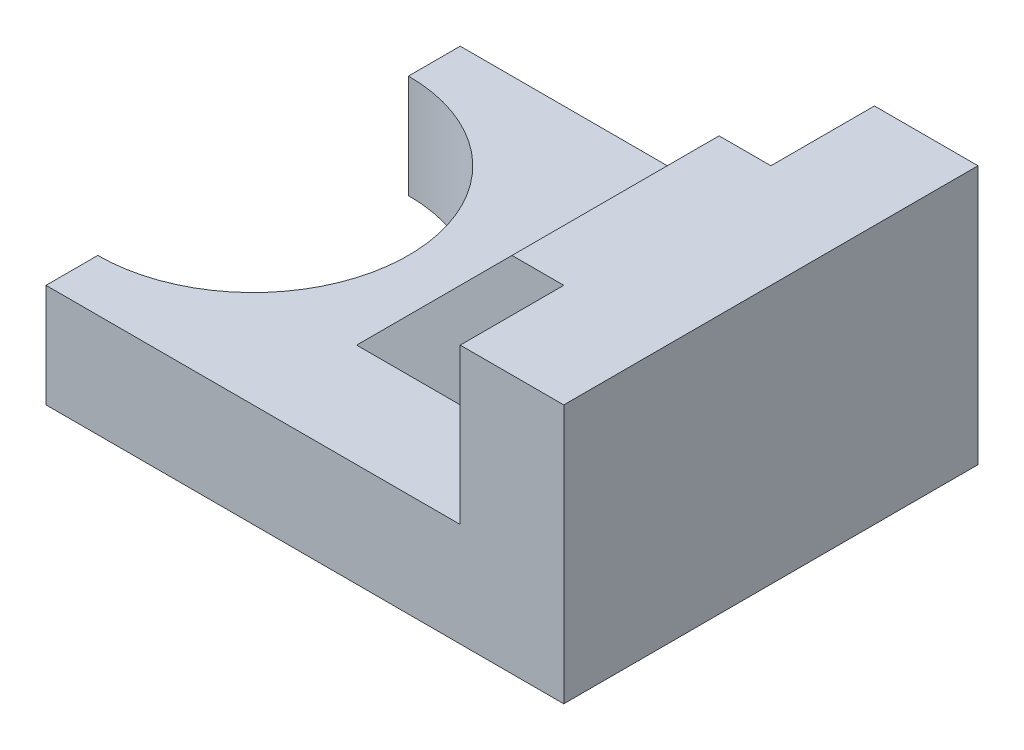
ISO-10303-21;
HEADER;
FILE_DESCRIPTION(('STEP AP214'),'2;1');
FILE_NAME('part.step','',(''),(''),'','','');
FILE_SCHEMA(('AUTOMOTIVE_DESIGN { 1 0 10303 214 1 1 1 1 }'));
ENDSEC;
DATA;
#1=APPLICATION_CONTEXT('core data for automotive mechanical design processes');
#2=APPLICATION_PROTOCOL_DEFINITION('international standard','automotive_design',2000,#1);
#3=PRODUCT_CONTEXT('',#1,'mechanical');
#4=PRODUCT('Part','Part','',(#3));
#5=PRODUCT_RELATED_PRODUCT_CATEGORY('part','',(#4));
#6=PRODUCT_DEFINITION_FORMATION('','',#4);
#7=PRODUCT_DEFINITION_CONTEXT('part definition',#1,'design');
#8=PRODUCT_DEFINITION('design','',#6,#7);
#9=PRODUCT_DEFINITION_SHAPE('','',#8);
#10=(LENGTH_UNIT() NAMED_UNIT(*) SI_UNIT(.MILLI.,.METRE.));
#11=(NAMED_UNIT(*) PLANE_ANGLE_UNIT() SI_UNIT($,.RADIAN.));
#12=(NAMED_UNIT(*) SI_UNIT($,.STERADIAN.) SOLID_ANGLE_UNIT());
#13=UNCERTAINTY_MEASURE_WITH_UNIT(LENGTH_MEASURE(1.E-05),#10,'distance_accuracy_value','');
#14=(GEOMETRIC_REPRESENTATION_CONTEXT(3) GLOBAL_UNCERTAINTY_ASSIGNED_CONTEXT((#13)) GLOBAL_UNIT_ASSIGNED_CONTEXT((#10,
#11,#12)) REPRESENTATION_CONTEXT('',''));
#15=CARTESIAN_POINT('',(0.,0.,0.));
#16=DIRECTION('',(0.,0.,1.));
#17=DIRECTION('',(1.,0.,0.));
#18=AXIS2_PLACEMENT_3D('',#15,#16,#17);
#19=CARTESIAN_POINT('',(-24.5117949113934,0.,20.));
#20=DIRECTION('',(-1.,0.,0.));
#21=DIRECTION('',(0.,0.,1.));
#22=AXIS2_PLACEMENT_3D('',#19,#20,#21);
#23=PLANE('',#22);
#24=DIRECTION('',(0.,1.,0.));
#25=VECTOR('',#24,1.);
#26=CARTESIAN_POINT('',(-24.5117949113934,-16.865406779661,15.));
#27=LINE('',#26,#25);
#28=CARTESIAN_POINT('',(-24.5117949113934,-16.864406779661,15.));
#29=VERTEX_POINT('',#28);
#30=CARTESIAN_POINT('',(-24.5117949113934,-6.86440677966101,15.));
#31=VERTEX_POINT('',#30);
#32=EDGE_CURVE('E137',#29,#31,#27,.T.);
#33=ORIENTED_EDGE('',*,*,#32,.F.);
#34=DIRECTION('',(0.,0.,-1.));
#35=VECTOR('',#34,1.);
#36=CARTESIAN_POINT('',(-24.5117949113934,-16.864406779661,20.));
#37=LINE('',#36,#35);
#38=CARTESIAN_POINT('',(-24.5117949113934,-16.864406779661,20.));
#39=VERTEX_POINT('',#38);
#40=EDGE_CURVE('E157',#39,#29,#37,.T.);
#41=ORIENTED_EDGE('',*,*,#40,.F.);
#42=DIRECTION('',(0.,1.,0.));
#43=VECTOR('',#42,1.);
#44=CARTESIAN_POINT('',(-24.5117949113934,0.,20.));
#45=LINE('',#44,#43);
#46=CARTESIAN_POINT('',(-24.5117949113934,-6.86440677966102,20.));
#47=VERTEX_POINT('',#46);
#48=EDGE_CURVE('E207',#39,#47,#45,.T.);
#49=ORIENTED_EDGE('',*,*,#48,.T.);
#50=DIRECTION('',(0.,0.,-1.));
#51=VECTOR('',#50,1.);
#52=CARTESIAN_POINT('',(-24.5117949113934,-6.86440677966102,20.));
#53=LINE('',#52,#51);
#54=EDGE_CURVE('E54',#47,#31,#53,.T.);
#55=ORIENTED_EDGE('',*,*,#54,.T.);
#56=EDGE_LOOP('',(#33,#41,#49,#55));
#57=FACE_BOUND('',#56,.T.);
#58=ADVANCED_FACE('F45',(#57),#23,.T.);
#59=CARTESIAN_POINT('',(0.,8.13559322033899,20.));
#60=DIRECTION('',(0.,1.,0.));
#61=DIRECTION('',(0.,0.,1.));
#62=AXIS2_PLACEMENT_3D('',#59,#60,#61);
#63=PLANE('',#62);
#64=DIRECTION('',(0.,0.,-1.));
#65=VECTOR('',#64,1.);
#66=CARTESIAN_POINT('',(15.4882050886066,8.13559322033899,-9.99999999999999));
#67=LINE('',#66,#65);
#68=CARTESIAN_POINT('',(15.4882050886066,8.13559322033899,-9.99999999999999));
#69=VERTEX_POINT('',#68);
#70=CARTESIAN_POINT('',(15.4882050886066,8.13559322033899,-20.));
#71=VERTEX_POINT('',#70);
#72=EDGE_CURVE('E69',#69,#71,#67,.T.);
#73=ORIENTED_EDGE('',*,*,#72,.F.);
#74=DIRECTION('',(1.,0.,0.));
#75=VECTOR('',#74,1.);
#76=CARTESIAN_POINT('',(10.4882050886066,8.13559322033899,-9.99999999999999));
#77=LINE('',#76,#75);
#78=CARTESIAN_POINT('',(10.4882050886066,8.13559322033899,-9.99999999999999));
#79=VERTEX_POINT('',#78);
#80=EDGE_CURVE('E249',#79,#69,#77,.T.);
#81=ORIENTED_EDGE('',*,*,#80,.F.);
#82=DIRECTION('',(0.,0.,-1.));
#83=VECTOR('',#82,1.);
#84=CARTESIAN_POINT('',(10.4882050886066,8.13559322033899,20.));
#85=LINE('',#84,#83);
#86=CARTESIAN_POINT('',(10.4882050886066,8.13559322033899,9.99999999999999));
#87=VERTEX_POINT('',#86);
#88=EDGE_CURVE('E170',#87,#79,#85,.T.);
#89=ORIENTED_EDGE('',*,*,#88,.F.);
#90=DIRECTION('',(-1.,0.,0.));
#91=VECTOR('',#90,1.);
#92=CARTESIAN_POINT('',(10.4882050886066,8.13559322033899,9.99999999999999));
#93=LINE('',#92,#91);
#94=CARTESIAN_POINT('',(15.4882050886066,8.13559322033899,9.99999999999999));
#95=VERTEX_POINT('',#94);
#96=EDGE_CURVE('E218',#95,#87,#93,.T.);
#97=ORIENTED_EDGE('',*,*,#96,.F.);
#98=DIRECTION('',(0.,0.,-1.));
#99=VECTOR('',#98,1.);
#100=CARTESIAN_POINT('',(15.4882050886066,8.13559322033899,20.000012));
#101=LINE('',#100,#99);
#102=CARTESIAN_POINT('',(15.4882050886066,8.13559322033899,20.));
#103=VERTEX_POINT('',#102);
#104=EDGE_CURVE('E215',#103,#95,#101,.T.);
#105=ORIENTED_EDGE('',*,*,#104,.F.);
#106=DIRECTION('',(1.,0.,0.));
#107=VECTOR('',#106,1.);
#108=CARTESIAN_POINT('',(0.,8.13559322033899,20.));
#109=LINE('',#108,#107);
#110=CARTESIAN_POINT('',(25.4882050886066,8.13559322033899,20.));
#111=VERTEX_POINT('',#110);
#112=EDGE_CURVE('E178',#103,#111,#109,.T.);
#113=ORIENTED_EDGE('',*,*,#112,.T.);
#114=DIRECTION('',(0.,0.,-1.));
#115=VECTOR('',#114,1.);
#116=CARTESIAN_POINT('',(25.4882050886066,8.13559322033899,20.));
#117=LINE('',#116,#115);
#118=CARTESIAN_POINT('',(25.4882050886066,8.13559322033899,-20.));
#119=VERTEX_POINT('',#118);
#120=EDGE_CURVE('E166',#111,#119,#117,.T.);
#121=ORIENTED_EDGE('',*,*,#120,.T.);
#122=DIRECTION('',(1.,0.,0.));
#123=VECTOR('',#122,1.);
#124=CARTESIAN_POINT('',(0.,8.13559322033899,-20.));
#125=LINE('',#124,#123);
#126=EDGE_CURVE('E179',#71,#119,#125,.T.);
#127=ORIENTED_EDGE('',*,*,#126,.F.);
#128=EDGE_LOOP('',(#73,#81,#89,#97,#105,#113,#121,#127));
#129=FACE_BOUND('',#128,.T.);
#130=ADVANCED_FACE('F276',(#129),#63,.T.);
#131=CARTESIAN_POINT('',(0.,0.,20.));
#132=DIRECTION('',(0.,0.,1.));
#133=DIRECTION('',(1.,0.,0.));
#134=AXIS2_PLACEMENT_3D('',#131,#132,#133);
#135=PLANE('',#134);
#136=DIRECTION('',(0.,-1.,0.));
#137=VECTOR('',#136,1.);
#138=CARTESIAN_POINT('',(15.4882050886066,0.,20.));
#139=LINE('',#138,#137);
#140=CARTESIAN_POINT('',(15.4882050886066,-6.86440677966101,20.));
#141=VERTEX_POINT('',#140);
#142=EDGE_CURVE('E11',#103,#141,#139,.T.);
#143=ORIENTED_EDGE('',*,*,#142,.T.);
#144=DIRECTION('',(1.,0.,0.));
#145=VECTOR('',#144,1.);
#146=CARTESIAN_POINT('',(0.,-6.86440677966101,20.));
#147=LINE('',#146,#145);
#148=EDGE_CURVE('E182',#47,#141,#147,.T.);
#149=ORIENTED_EDGE('',*,*,#148,.F.);
#150=ORIENTED_EDGE('',*,*,#48,.F.);
#151=DIRECTION('',(-1.,0.,0.));
#152=VECTOR('',#151,1.);
#153=CARTESIAN_POINT('',(0.,-16.864406779661,20.));
#154=LINE('',#153,#152);
#155=CARTESIAN_POINT('',(25.4882050886066,-16.864406779661,20.));
#156=VERTEX_POINT('',#155);
#157=EDGE_CURVE('E203',#156,#39,#154,.T.);
#158=ORIENTED_EDGE('',*,*,#157,.F.);
#159=DIRECTION('',(0.,-1.,0.));
#160=VECTOR('',#159,1.);
#161=CARTESIAN_POINT('',(25.4882050886066,0.,20.));
#162=LINE('',#161,#160);
#163=EDGE_CURVE('E199',#111,#156,#162,.T.);
#164=ORIENTED_EDGE('',*,*,#163,.F.);
#165=ORIENTED_EDGE('',*,*,#112,.F.);
#166=EDGE_LOOP('',(#143,#149,#150,#158,#164,#165));
#167=FACE_BOUND('',#166,.T.);
#168=ADVANCED_FACE('F266',(#167),#135,.T.);
#169=CARTESIAN_POINT('',(0.,-6.86440677966101,20.));
#170=DIRECTION('',(0.,1.,0.));
#171=DIRECTION('',(-1.,0.,0.));
#172=AXIS2_PLACEMENT_3D('',#169,#170,#171);
#173=PLANE('',#172);
#174=CARTESIAN_POINT('',(-24.5117949113934,-6.86440677966101,0.));
#175=DIRECTION('',(0.,1.,0.));
#176=DIRECTION('',(1.,0.,0.));
#177=AXIS2_PLACEMENT_3D('',#174,#175,#176);
#178=CIRCLE('',#177,15.);
#179=CARTESIAN_POINT('',(-24.5117949113934,-6.86440677966101,-15.));
#180=VERTEX_POINT('',#179);
#181=EDGE_CURVE('E134',#31,#180,#178,.T.);
#182=ORIENTED_EDGE('',*,*,#181,.F.);
#183=ORIENTED_EDGE('',*,*,#54,.F.);
#184=ORIENTED_EDGE('',*,*,#148,.T.);
#185=DIRECTION('',(0.,0.,-1.));
#186=VECTOR('',#185,1.);
#187=CARTESIAN_POINT('',(15.4882050886066,-6.86440677966101,20.000012));
#188=LINE('',#187,#186);
#189=CARTESIAN_POINT('',(15.4882050886066,-6.86440677966101,9.99999999999999));
#190=VERTEX_POINT('',#189);
#191=EDGE_CURVE('E196',#141,#190,#188,.T.);
#192=ORIENTED_EDGE('',*,*,#191,.T.);
#193=DIRECTION('',(1.,0.,0.));
#194=VECTOR('',#193,1.);
#195=CARTESIAN_POINT('',(-4.51179491139337,-6.86440677966101,9.99999999999999));
#196=LINE('',#195,#194);
#197=CARTESIAN_POINT('',(-4.51179491139337,-6.86440677966101,9.99999999999999));
#198=VERTEX_POINT('',#197);
#199=EDGE_CURVE('E225',#198,#190,#196,.T.);
#200=ORIENTED_EDGE('',*,*,#199,.F.);
#201=DIRECTION('',(0.,0.,-1.));
#202=VECTOR('',#201,1.);
#203=CARTESIAN_POINT('',(-4.51179491139337,-6.86440677966101,20.));
#204=LINE('',#203,#202);
#205=CARTESIAN_POINT('',(-4.51179491139337,-6.86440677966101,-9.99999999999999));
#206=VERTEX_POINT('',#205);
#207=EDGE_CURVE('E174',#198,#206,#204,.T.);
#208=ORIENTED_EDGE('',*,*,#207,.T.);
#209=DIRECTION('',(-1.,0.,0.));
#210=VECTOR('',#209,1.);
#211=CARTESIAN_POINT('',(-4.51179491139337,-6.86440677966101,-9.99999999999999));
#212=LINE('',#211,#210);
#213=CARTESIAN_POINT('',(15.4882050886066,-6.86440677966101,-9.99999999999999));
#214=VERTEX_POINT('',#213);
#215=EDGE_CURVE('E236',#214,#206,#212,.T.);
#216=ORIENTED_EDGE('',*,*,#215,.F.);
#217=DIRECTION('',(0.,0.,-1.));
#218=VECTOR('',#217,1.);
#219=CARTESIAN_POINT('',(15.4882050886066,-6.86440677966101,-9.99999999999999));
#220=LINE('',#219,#218);
#221=CARTESIAN_POINT('',(15.4882050886066,-6.86440677966101,-20.));
#222=VERTEX_POINT('',#221);
#223=EDGE_CURVE('E233',#214,#222,#220,.T.);
#224=ORIENTED_EDGE('',*,*,#223,.T.);
#225=DIRECTION('',(1.,0.,0.));
#226=VECTOR('',#225,1.);
#227=CARTESIAN_POINT('',(0.,-6.86440677966101,-20.));
#228=LINE('',#227,#226);
#229=CARTESIAN_POINT('',(-24.5117949113934,-6.86440677966102,-20.));
#230=VERTEX_POINT('',#229);
#231=EDGE_CURVE('E154',#230,#222,#228,.T.);
#232=ORIENTED_EDGE('',*,*,#231,.F.);
#233=EDGE_CURVE('E148',#180,#230,#53,.T.);
#234=ORIENTED_EDGE('',*,*,#233,.F.);
#235=EDGE_LOOP('',(#182,#183,#184,#192,#200,#208,#216,#224,#232,#234));
#236=FACE_BOUND('',#235,.T.);
#237=ADVANCED_FACE('F47',(#236),#173,.T.);
#238=DIRECTION('',(0.,1.,0.));
#239=VECTOR('',#238,1.);
#240=CARTESIAN_POINT('',(-24.5117949113934,-16.865406779661,-15.));
#241=LINE('',#240,#239);
#242=CARTESIAN_POINT('',(-24.5117949113934,-16.864406779661,-15.));
#243=VERTEX_POINT('',#242);
#244=EDGE_CURVE('E61',#243,#180,#241,.T.);
#245=ORIENTED_EDGE('',*,*,#244,.T.);
#246=ORIENTED_EDGE('',*,*,#233,.T.);
#247=DIRECTION('',(0.,1.,0.));
#248=VECTOR('',#247,1.);
#249=CARTESIAN_POINT('',(-24.5117949113934,0.,-20.));
#250=LINE('',#249,#248);
#251=CARTESIAN_POINT('',(-24.5117949113934,-16.864406779661,-20.));
#252=VERTEX_POINT('',#251);
#253=EDGE_CURVE('E191',#252,#230,#250,.T.);
#254=ORIENTED_EDGE('',*,*,#253,.F.);
#255=EDGE_CURVE('E150',#243,#252,#37,.T.);
#256=ORIENTED_EDGE('',*,*,#255,.F.);
#257=EDGE_LOOP('',(#245,#246,#254,#256));
#258=FACE_BOUND('',#257,.T.);
#259=ADVANCED_FACE('F146',(#258),#23,.T.);
#260=CARTESIAN_POINT('',(0.,-16.864406779661,20.));
#261=DIRECTION('',(0.,-1.,0.));
#262=DIRECTION('',(1.,0.,0.));
#263=AXIS2_PLACEMENT_3D('',#260,#261,#262);
#264=PLANE('',#263);
#265=CARTESIAN_POINT('',(-24.5117949113934,-16.864406779661,0.));
#266=DIRECTION('',(0.,-1.,0.));
#267=DIRECTION('',(1.,0.,0.));
#268=AXIS2_PLACEMENT_3D('',#265,#266,#267);
#269=CIRCLE('',#268,15.);
#270=EDGE_CURVE('E142',#29,#243,#269,.F.);
#271=ORIENTED_EDGE('',*,*,#270,.T.);
#272=ORIENTED_EDGE('',*,*,#255,.T.);
#273=DIRECTION('',(-1.,0.,0.));
#274=VECTOR('',#273,1.);
#275=CARTESIAN_POINT('',(0.,-16.864406779661,-20.));
#276=LINE('',#275,#274);
#277=CARTESIAN_POINT('',(25.4882050886066,-16.864406779661,-20.));
#278=VERTEX_POINT('',#277);
#279=EDGE_CURVE('E187',#278,#252,#276,.T.);
#280=ORIENTED_EDGE('',*,*,#279,.F.);
#281=DIRECTION('',(0.,0.,-1.));
#282=VECTOR('',#281,1.);
#283=CARTESIAN_POINT('',(25.4882050886066,-16.864406779661,20.));
#284=LINE('',#283,#282);
#285=EDGE_CURVE('E163',#156,#278,#284,.T.);
#286=ORIENTED_EDGE('',*,*,#285,.F.);
#287=ORIENTED_EDGE('',*,*,#157,.T.);
#288=ORIENTED_EDGE('',*,*,#40,.T.);
#289=EDGE_LOOP('',(#271,#272,#280,#286,#287,#288));
#290=FACE_BOUND('',#289,.T.);
#291=ADVANCED_FACE('F259',(#290),#264,.T.);
#292=CARTESIAN_POINT('',(25.4882050886066,0.,20.));
#293=DIRECTION('',(1.,0.,0.));
#294=DIRECTION('',(0.,0.,-1.));
#295=AXIS2_PLACEMENT_3D('',#292,#293,#294);
#296=PLANE('',#295);
#297=DIRECTION('',(0.,-1.,0.));
#298=VECTOR('',#297,1.);
#299=CARTESIAN_POINT('',(25.4882050886066,0.,-20.));
#300=LINE('',#299,#298);
#301=EDGE_CURVE('E183',#119,#278,#300,.T.);
#302=ORIENTED_EDGE('',*,*,#301,.F.);
#303=ORIENTED_EDGE('',*,*,#120,.F.);
#304=ORIENTED_EDGE('',*,*,#163,.T.);
#305=ORIENTED_EDGE('',*,*,#285,.T.);
#306=EDGE_LOOP('',(#302,#303,#304,#305));
#307=FACE_BOUND('',#306,.T.);
#308=ADVANCED_FACE('F296',(#307),#296,.T.);
#309=CARTESIAN_POINT('',(1.17630593413382,-1.17630593413382,20.));
#310=DIRECTION('',(0.707106781186548,-0.707106781186547,0.));
#311=DIRECTION('',(0.707106781186547,0.707106781186548,0.));
#312=AXIS2_PLACEMENT_3D('',#309,#310,#311);
#313=PLANE('',#312);
#314=ORIENTED_EDGE('',*,*,#88,.T.);
#315=DIRECTION('',(0.707106781186547,0.707106781186548,0.));
#316=VECTOR('',#315,1.);
#317=CARTESIAN_POINT('',(10.4882050886066,8.13559322033899,-9.99999999999999));
#318=LINE('',#317,#316);
#319=EDGE_CURVE('E242',#206,#79,#318,.T.);
#320=ORIENTED_EDGE('',*,*,#319,.F.);
#321=ORIENTED_EDGE('',*,*,#207,.F.);
#322=DIRECTION('',(-0.707106781186547,-0.707106781186548,0.));
#323=VECTOR('',#322,1.);
#324=CARTESIAN_POINT('',(-4.51179491139337,-6.86440677966101,9.99999999999999));
#325=LINE('',#324,#323);
#326=EDGE_CURVE('E229',#87,#198,#325,.T.);
#327=ORIENTED_EDGE('',*,*,#326,.F.);
#328=EDGE_LOOP('',(#314,#320,#321,#327));
#329=FACE_BOUND('',#328,.T.);
#330=ADVANCED_FACE('F285',(#329),#313,.F.);
#331=CARTESIAN_POINT('',(0.,0.,-20.));
#332=DIRECTION('',(0.,0.,1.));
#333=DIRECTION('',(1.,0.,0.));
#334=AXIS2_PLACEMENT_3D('',#331,#332,#333);
#335=PLANE('',#334);
#336=ORIENTED_EDGE('',*,*,#231,.T.);
#337=DIRECTION('',(0.,-1.,0.));
#338=VECTOR('',#337,1.);
#339=CARTESIAN_POINT('',(15.4882050886066,8.13559322033899,-20.));
#340=LINE('',#339,#338);
#341=EDGE_CURVE('E239',#71,#222,#340,.T.);
#342=ORIENTED_EDGE('',*,*,#341,.F.);
#343=ORIENTED_EDGE('',*,*,#126,.T.);
#344=ORIENTED_EDGE('',*,*,#301,.T.);
#345=ORIENTED_EDGE('',*,*,#279,.T.);
#346=ORIENTED_EDGE('',*,*,#253,.T.);
#347=EDGE_LOOP('',(#336,#342,#343,#344,#345,#346));
#348=FACE_BOUND('',#347,.T.);
#349=ADVANCED_FACE('F293',(#348),#335,.F.);
#350=CARTESIAN_POINT('',(15.4882050886066,8.13559322033899,20.000012));
#351=DIRECTION('',(-1.,0.,0.));
#352=DIRECTION('',(0.,-1.,0.));
#353=AXIS2_PLACEMENT_3D('',#350,#351,#352);
#354=PLANE('',#353);
#355=ORIENTED_EDGE('',*,*,#104,.T.);
#356=DIRECTION('',(0.,1.,0.));
#357=VECTOR('',#356,1.);
#358=CARTESIAN_POINT('',(15.4882050886066,8.13559322033899,9.99999999999999));
#359=LINE('',#358,#357);
#360=EDGE_CURVE('E221',#190,#95,#359,.T.);
#361=ORIENTED_EDGE('',*,*,#360,.F.);
#362=ORIENTED_EDGE('',*,*,#191,.F.);
#363=ORIENTED_EDGE('',*,*,#142,.F.);
#364=EDGE_LOOP('',(#355,#361,#362,#363));
#365=FACE_BOUND('',#364,.T.);
#366=ADVANCED_FACE('F272',(#365),#354,.T.);
#367=CARTESIAN_POINT('',(0.,0.,9.99999999999999));
#368=DIRECTION('',(0.,0.,-1.));
#369=DIRECTION('',(-1.,0.,0.));
#370=AXIS2_PLACEMENT_3D('',#367,#368,#369);
#371=PLANE('',#370);
#372=ORIENTED_EDGE('',*,*,#326,.T.);
#373=ORIENTED_EDGE('',*,*,#199,.T.);
#374=ORIENTED_EDGE('',*,*,#360,.T.);
#375=ORIENTED_EDGE('',*,*,#96,.T.);
#376=EDGE_LOOP('',(#372,#373,#374,#375));
#377=FACE_BOUND('',#376,.T.);
#378=ADVANCED_FACE('F282',(#377),#371,.F.);
#379=CARTESIAN_POINT('',(15.4882050886066,8.13559322033899,-9.99999999999999));
#380=DIRECTION('',(1.,0.,0.));
#381=DIRECTION('',(0.,1.,0.));
#382=AXIS2_PLACEMENT_3D('',#379,#380,#381);
#383=PLANE('',#382);
#384=ORIENTED_EDGE('',*,*,#341,.T.);
#385=ORIENTED_EDGE('',*,*,#223,.F.);
#386=DIRECTION('',(0.,-1.,0.));
#387=VECTOR('',#386,1.);
#388=CARTESIAN_POINT('',(15.4882050886066,8.13559322033899,-9.99999999999999));
#389=LINE('',#388,#387);
#390=EDGE_CURVE('E245',#69,#214,#389,.T.);
#391=ORIENTED_EDGE('',*,*,#390,.F.);
#392=ORIENTED_EDGE('',*,*,#72,.T.);
#393=EDGE_LOOP('',(#384,#385,#391,#392));
#394=FACE_BOUND('',#393,.T.);
#395=ADVANCED_FACE('F290',(#394),#383,.F.);
#396=CARTESIAN_POINT('',(0.,0.,-9.99999999999999));
#397=DIRECTION('',(0.,0.,1.));
#398=DIRECTION('',(1.,0.,0.));
#399=AXIS2_PLACEMENT_3D('',#396,#397,#398);
#400=PLANE('',#399);
#401=ORIENTED_EDGE('',*,*,#319,.T.);
#402=ORIENTED_EDGE('',*,*,#80,.T.);
#403=ORIENTED_EDGE('',*,*,#390,.T.);
#404=ORIENTED_EDGE('',*,*,#215,.T.);
#405=EDGE_LOOP('',(#401,#402,#403,#404));
#406=FACE_BOUND('',#405,.T.);
#407=ADVANCED_FACE('F289',(#406),#400,.F.);
#408=CARTESIAN_POINT('',(-24.5117949113934,-16.865406779661,0.));
#409=DIRECTION('',(0.,1.,0.));
#410=DIRECTION('',(-1.,0.,0.));
#411=AXIS2_PLACEMENT_3D('',#408,#409,#410);
#412=CYLINDRICAL_SURFACE('',#411,15.);
#413=ORIENTED_EDGE('',*,*,#32,.T.);
#414=ORIENTED_EDGE('',*,*,#181,.T.);
#415=ORIENTED_EDGE('',*,*,#244,.F.);
#416=ORIENTED_EDGE('',*,*,#270,.F.);
#417=EDGE_LOOP('',(#413,#414,#415,#416));
#418=FACE_BOUND('',#417,.T.);
#419=ADVANCED_FACE('F135',(#418),#412,.F.);
#420=CLOSED_SHELL('',(#58,#130,#168,#237,#259,#291,#308,#330,#349,#366,#378,#395,#407,#419));
#421=MANIFOLD_SOLID_BREP('B2',#420);
#422=ADVANCED_BREP_SHAPE_REPRESENTATION('',(#18,#421),#14);
#423=SHAPE_DEFINITION_REPRESENTATION(#9,#422);
ENDSEC;
END-ISO-10303-21;
